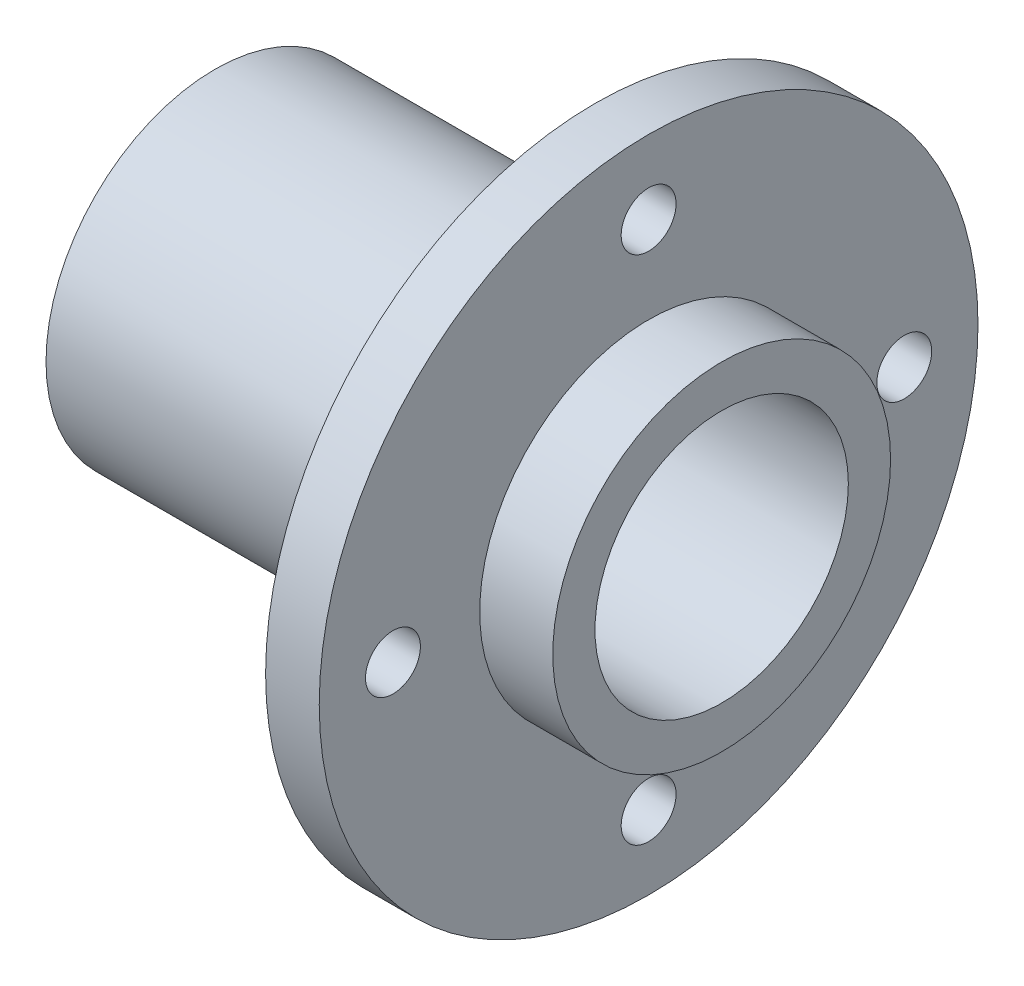
ISO-10303-21;
HEADER;
FILE_DESCRIPTION(('STEP AP214'),'2;1');
FILE_NAME('part.step','',(''),(''),'','','');
FILE_SCHEMA(('AUTOMOTIVE_DESIGN { 1 0 10303 214 1 1 1 1 }'));
ENDSEC;
DATA;
#1=APPLICATION_CONTEXT('core data for automotive mechanical design processes');
#2=APPLICATION_PROTOCOL_DEFINITION('international standard','automotive_design',2000,#1);
#3=PRODUCT_CONTEXT('',#1,'mechanical');
#4=PRODUCT('Part','Part','',(#3));
#5=PRODUCT_RELATED_PRODUCT_CATEGORY('part','',(#4));
#6=PRODUCT_DEFINITION_FORMATION('','',#4);
#7=PRODUCT_DEFINITION_CONTEXT('part definition',#1,'design');
#8=PRODUCT_DEFINITION('design','',#6,#7);
#9=PRODUCT_DEFINITION_SHAPE('','',#8);
#10=(LENGTH_UNIT() NAMED_UNIT(*) SI_UNIT(.MILLI.,.METRE.));
#11=(NAMED_UNIT(*) PLANE_ANGLE_UNIT() SI_UNIT($,.RADIAN.));
#12=(NAMED_UNIT(*) SI_UNIT($,.STERADIAN.) SOLID_ANGLE_UNIT());
#13=UNCERTAINTY_MEASURE_WITH_UNIT(LENGTH_MEASURE(1.E-05),#10,'distance_accuracy_value','');
#14=(GEOMETRIC_REPRESENTATION_CONTEXT(3) GLOBAL_UNCERTAINTY_ASSIGNED_CONTEXT((#13)) GLOBAL_UNIT_ASSIGNED_CONTEXT((#10,
#11,#12)) REPRESENTATION_CONTEXT('',''));
#15=CARTESIAN_POINT('',(0.,0.,0.));
#16=DIRECTION('',(0.,0.,1.));
#17=DIRECTION('',(1.,0.,0.));
#18=AXIS2_PLACEMENT_3D('',#15,#16,#17);
#19=CARTESIAN_POINT('',(0.,0.,0.));
#20=DIRECTION('',(1.,0.,0.));
#21=DIRECTION('',(0.,0.,-1.));
#22=AXIS2_PLACEMENT_3D('',#19,#20,#21);
#23=PLANE('',#22);
#24=CARTESIAN_POINT('',(0.,30.27,0.));
#25=DIRECTION('',(-1.,0.,0.));
#26=DIRECTION('',(0.,0.,1.));
#27=AXIS2_PLACEMENT_3D('',#24,#25,#26);
#28=CIRCLE('',#27,3.25);
#29=CARTESIAN_POINT('',(0.,30.27,3.25));
#30=VERTEX_POINT('',#29);
#31=EDGE_CURVE('E60',#30,#30,#28,.T.);
#32=ORIENTED_EDGE('',*,*,#31,.F.);
#33=EDGE_LOOP('',(#32));
#34=FACE_BOUND('',#33,.T.);
#35=CARTESIAN_POINT('',(0.,0.,-30.27));
#36=DIRECTION('',(-1.,0.,0.));
#37=DIRECTION('',(0.,0.,1.));
#38=AXIS2_PLACEMENT_3D('',#35,#36,#37);
#39=CIRCLE('',#38,3.25);
#40=CARTESIAN_POINT('',(0.,0.,-27.02));
#41=VERTEX_POINT('',#40);
#42=EDGE_CURVE('E152',#41,#41,#39,.T.);
#43=ORIENTED_EDGE('',*,*,#42,.F.);
#44=EDGE_LOOP('',(#43));
#45=FACE_BOUND('',#44,.T.);
#46=CARTESIAN_POINT('',(0.,0.,30.27));
#47=DIRECTION('',(-1.,0.,0.));
#48=DIRECTION('',(0.,0.,1.));
#49=AXIS2_PLACEMENT_3D('',#46,#47,#48);
#50=CIRCLE('',#49,3.25);
#51=CARTESIAN_POINT('',(0.,0.,33.52));
#52=VERTEX_POINT('',#51);
#53=EDGE_CURVE('E156',#52,#52,#50,.T.);
#54=ORIENTED_EDGE('',*,*,#53,.F.);
#55=EDGE_LOOP('',(#54));
#56=FACE_BOUND('',#55,.T.);
#57=CARTESIAN_POINT('',(0.,-30.27,0.));
#58=DIRECTION('',(-1.,0.,0.));
#59=DIRECTION('',(0.,0.,1.));
#60=AXIS2_PLACEMENT_3D('',#57,#58,#59);
#61=CIRCLE('',#60,3.25);
#62=CARTESIAN_POINT('',(0.,-30.27,3.25));
#63=VERTEX_POINT('',#62);
#64=EDGE_CURVE('E84',#63,#63,#61,.T.);
#65=ORIENTED_EDGE('',*,*,#64,.F.);
#66=EDGE_LOOP('',(#65));
#67=FACE_BOUND('',#66,.T.);
#68=CARTESIAN_POINT('',(0.,0.,0.));
#69=DIRECTION('',(1.,0.,0.));
#70=DIRECTION('',(0.,0.,-1.));
#71=AXIS2_PLACEMENT_3D('',#68,#69,#70);
#72=CIRCLE('',#71,39.);
#73=CARTESIAN_POINT('',(0.,0.,-39.));
#74=VERTEX_POINT('',#73);
#75=EDGE_CURVE('E51',#74,#74,#72,.T.);
#76=ORIENTED_EDGE('',*,*,#75,.F.);
#77=EDGE_LOOP('',(#76));
#78=FACE_BOUND('',#77,.T.);
#79=CARTESIAN_POINT('',(0.,0.,0.));
#80=DIRECTION('',(1.,0.,0.));
#81=DIRECTION('',(0.,0.,-1.));
#82=AXIS2_PLACEMENT_3D('',#79,#80,#81);
#83=CIRCLE('',#82,20.);
#84=CARTESIAN_POINT('',(0.,0.,-20.));
#85=VERTEX_POINT('',#84);
#86=EDGE_CURVE('E10',#85,#85,#83,.F.);
#87=ORIENTED_EDGE('',*,*,#86,.F.);
#88=EDGE_LOOP('',(#87));
#89=FACE_BOUND('',#88,.T.);
#90=ADVANCED_FACE('F36',(#34,#45,#56,#67,#78,#89),#23,.F.);
#91=CARTESIAN_POINT('',(6.35,0.,0.));
#92=DIRECTION('',(1.,0.,0.));
#93=DIRECTION('',(0.,0.,-1.));
#94=AXIS2_PLACEMENT_3D('',#91,#92,#93);
#95=PLANE('',#94);
#96=CARTESIAN_POINT('',(6.35,30.27,0.));
#97=DIRECTION('',(1.,0.,0.));
#98=DIRECTION('',(0.,0.,-1.));
#99=AXIS2_PLACEMENT_3D('',#96,#97,#98);
#100=CIRCLE('',#99,3.25);
#101=CARTESIAN_POINT('',(6.35,30.27,-3.25));
#102=VERTEX_POINT('',#101);
#103=EDGE_CURVE('E40',#102,#102,#100,.T.);
#104=ORIENTED_EDGE('',*,*,#103,.F.);
#105=EDGE_LOOP('',(#104));
#106=FACE_BOUND('',#105,.T.);
#107=CARTESIAN_POINT('',(6.35,0.,-30.27));
#108=DIRECTION('',(1.,0.,0.));
#109=DIRECTION('',(0.,0.,-1.));
#110=AXIS2_PLACEMENT_3D('',#107,#108,#109);
#111=CIRCLE('',#110,3.25);
#112=CARTESIAN_POINT('',(6.35,0.,-33.52));
#113=VERTEX_POINT('',#112);
#114=EDGE_CURVE('E63',#113,#113,#111,.T.);
#115=ORIENTED_EDGE('',*,*,#114,.F.);
#116=EDGE_LOOP('',(#115));
#117=FACE_BOUND('',#116,.T.);
#118=CARTESIAN_POINT('',(6.35,0.,30.27));
#119=DIRECTION('',(1.,0.,0.));
#120=DIRECTION('',(0.,0.,-1.));
#121=AXIS2_PLACEMENT_3D('',#118,#119,#120);
#122=CIRCLE('',#121,3.25);
#123=CARTESIAN_POINT('',(6.35,0.,27.02));
#124=VERTEX_POINT('',#123);
#125=EDGE_CURVE('E59',#124,#124,#122,.T.);
#126=ORIENTED_EDGE('',*,*,#125,.F.);
#127=EDGE_LOOP('',(#126));
#128=FACE_BOUND('',#127,.T.);
#129=CARTESIAN_POINT('',(6.35,-30.27,0.));
#130=DIRECTION('',(1.,0.,0.));
#131=DIRECTION('',(0.,0.,-1.));
#132=AXIS2_PLACEMENT_3D('',#129,#130,#131);
#133=CIRCLE('',#132,3.25);
#134=CARTESIAN_POINT('',(6.35,-30.27,-3.25));
#135=VERTEX_POINT('',#134);
#136=EDGE_CURVE('E55',#135,#135,#133,.T.);
#137=ORIENTED_EDGE('',*,*,#136,.F.);
#138=EDGE_LOOP('',(#137));
#139=FACE_BOUND('',#138,.T.);
#140=CARTESIAN_POINT('',(6.35,0.,0.));
#141=DIRECTION('',(1.,0.,0.));
#142=DIRECTION('',(0.,0.,-1.));
#143=AXIS2_PLACEMENT_3D('',#140,#141,#142);
#144=CIRCLE('',#143,39.);
#145=CARTESIAN_POINT('',(6.35,0.,-39.));
#146=VERTEX_POINT('',#145);
#147=EDGE_CURVE('E45',#146,#146,#144,.T.);
#148=ORIENTED_EDGE('',*,*,#147,.T.);
#149=EDGE_LOOP('',(#148));
#150=FACE_BOUND('',#149,.T.);
#151=CARTESIAN_POINT('',(6.35,0.,0.));
#152=DIRECTION('',(1.,0.,0.));
#153=DIRECTION('',(0.,0.,-1.));
#154=AXIS2_PLACEMENT_3D('',#151,#152,#153);
#155=CIRCLE('',#154,20.);
#156=CARTESIAN_POINT('',(6.35,0.,-20.));
#157=VERTEX_POINT('',#156);
#158=EDGE_CURVE('E90',#157,#157,#155,.T.);
#159=ORIENTED_EDGE('',*,*,#158,.F.);
#160=EDGE_LOOP('',(#159));
#161=FACE_BOUND('',#160,.T.);
#162=ADVANCED_FACE('F101',(#106,#117,#128,#139,#150,#161),#95,.T.);
#163=CARTESIAN_POINT('',(6.35,0.,0.));
#164=DIRECTION('',(-1.,0.,0.));
#165=DIRECTION('',(0.,0.,1.));
#166=AXIS2_PLACEMENT_3D('',#163,#164,#165);
#167=CYLINDRICAL_SURFACE('',#166,39.);
#168=ORIENTED_EDGE('',*,*,#147,.F.);
#169=EDGE_LOOP('',(#168));
#170=FACE_BOUND('',#169,.T.);
#171=ORIENTED_EDGE('',*,*,#75,.T.);
#172=EDGE_LOOP('',(#171));
#173=FACE_BOUND('',#172,.T.);
#174=ADVANCED_FACE('F38',(#170,#173),#167,.T.);
#175=CARTESIAN_POINT('',(0.,0.,0.));
#176=DIRECTION('',(1.,0.,0.));
#177=DIRECTION('',(0.,0.,-1.));
#178=AXIS2_PLACEMENT_3D('',#175,#176,#177);
#179=CYLINDRICAL_SURFACE('',#178,15.);
#180=CARTESIAN_POINT('',(15.,0.,0.));
#181=DIRECTION('',(1.,0.,0.));
#182=DIRECTION('',(0.,0.,-1.));
#183=AXIS2_PLACEMENT_3D('',#180,#181,#182);
#184=CIRCLE('',#183,15.);
#185=CARTESIAN_POINT('',(15.,0.,-15.));
#186=VERTEX_POINT('',#185);
#187=EDGE_CURVE('E81',#186,#186,#184,.T.);
#188=ORIENTED_EDGE('',*,*,#187,.T.);
#189=EDGE_LOOP('',(#188));
#190=FACE_BOUND('',#189,.T.);
#191=CARTESIAN_POINT('',(-45.,0.,0.));
#192=DIRECTION('',(-1.,0.,0.));
#193=DIRECTION('',(0.,0.,1.));
#194=AXIS2_PLACEMENT_3D('',#191,#192,#193);
#195=CIRCLE('',#194,15.);
#196=CARTESIAN_POINT('',(-45.,0.,15.));
#197=VERTEX_POINT('',#196);
#198=EDGE_CURVE('E70',#197,#197,#195,.T.);
#199=ORIENTED_EDGE('',*,*,#198,.T.);
#200=EDGE_LOOP('',(#199));
#201=FACE_BOUND('',#200,.T.);
#202=ADVANCED_FACE('F110',(#190,#201),#179,.F.);
#203=CARTESIAN_POINT('',(15.,0.,0.));
#204=DIRECTION('',(1.,0.,0.));
#205=DIRECTION('',(0.,0.,-1.));
#206=AXIS2_PLACEMENT_3D('',#203,#204,#205);
#207=PLANE('',#206);
#208=CARTESIAN_POINT('',(15.,0.,0.));
#209=DIRECTION('',(1.,0.,0.));
#210=DIRECTION('',(0.,0.,-1.));
#211=AXIS2_PLACEMENT_3D('',#208,#209,#210);
#212=CIRCLE('',#211,20.);
#213=CARTESIAN_POINT('',(15.,0.,-20.));
#214=VERTEX_POINT('',#213);
#215=EDGE_CURVE('E91',#214,#214,#212,.T.);
#216=ORIENTED_EDGE('',*,*,#215,.T.);
#217=EDGE_LOOP('',(#216));
#218=FACE_BOUND('',#217,.T.);
#219=ORIENTED_EDGE('',*,*,#187,.F.);
#220=EDGE_LOOP('',(#219));
#221=FACE_BOUND('',#220,.T.);
#222=ADVANCED_FACE('F117',(#218,#221),#207,.T.);
#223=CARTESIAN_POINT('',(15.,0.,0.));
#224=DIRECTION('',(-1.,0.,0.));
#225=DIRECTION('',(0.,0.,1.));
#226=AXIS2_PLACEMENT_3D('',#223,#224,#225);
#227=CYLINDRICAL_SURFACE('',#226,20.);
#228=ORIENTED_EDGE('',*,*,#215,.F.);
#229=EDGE_LOOP('',(#228));
#230=FACE_BOUND('',#229,.T.);
#231=ORIENTED_EDGE('',*,*,#158,.T.);
#232=EDGE_LOOP('',(#231));
#233=FACE_BOUND('',#232,.T.);
#234=ADVANCED_FACE('F99',(#230,#233),#227,.T.);
#235=CARTESIAN_POINT('',(-45.,0.,0.));
#236=DIRECTION('',(-1.,0.,0.));
#237=DIRECTION('',(0.,0.,1.));
#238=AXIS2_PLACEMENT_3D('',#235,#236,#237);
#239=PLANE('',#238);
#240=CARTESIAN_POINT('',(-45.,0.,0.));
#241=DIRECTION('',(-1.,0.,0.));
#242=DIRECTION('',(0.,0.,1.));
#243=AXIS2_PLACEMENT_3D('',#240,#241,#242);
#244=CIRCLE('',#243,20.);
#245=CARTESIAN_POINT('',(-45.,0.,20.));
#246=VERTEX_POINT('',#245);
#247=EDGE_CURVE('E75',#246,#246,#244,.T.);
#248=ORIENTED_EDGE('',*,*,#247,.T.);
#249=EDGE_LOOP('',(#248));
#250=FACE_BOUND('',#249,.T.);
#251=ORIENTED_EDGE('',*,*,#198,.F.);
#252=EDGE_LOOP('',(#251));
#253=FACE_BOUND('',#252,.T.);
#254=ADVANCED_FACE('F121',(#250,#253),#239,.T.);
#255=CARTESIAN_POINT('',(-45.,0.,0.));
#256=DIRECTION('',(1.,0.,0.));
#257=DIRECTION('',(0.,0.,-1.));
#258=AXIS2_PLACEMENT_3D('',#255,#256,#257);
#259=CYLINDRICAL_SURFACE('',#258,20.);
#260=ORIENTED_EDGE('',*,*,#247,.F.);
#261=EDGE_LOOP('',(#260));
#262=FACE_BOUND('',#261,.T.);
#263=ORIENTED_EDGE('',*,*,#86,.T.);
#264=EDGE_LOOP('',(#263));
#265=FACE_BOUND('',#264,.T.);
#266=ADVANCED_FACE('F126',(#262,#265),#259,.T.);
#267=CARTESIAN_POINT('',(45.,-30.27,0.));
#268=DIRECTION('',(-1.,0.,0.));
#269=DIRECTION('',(0.,0.,1.));
#270=AXIS2_PLACEMENT_3D('',#267,#268,#269);
#271=CYLINDRICAL_SURFACE('',#270,3.25);
#272=ORIENTED_EDGE('',*,*,#136,.T.);
#273=EDGE_LOOP('',(#272));
#274=FACE_BOUND('',#273,.T.);
#275=ORIENTED_EDGE('',*,*,#64,.T.);
#276=EDGE_LOOP('',(#275));
#277=FACE_BOUND('',#276,.T.);
#278=ADVANCED_FACE('F129',(#274,#277),#271,.F.);
#279=CARTESIAN_POINT('',(45.,0.,30.27));
#280=DIRECTION('',(-1.,0.,0.));
#281=DIRECTION('',(0.,0.,1.));
#282=AXIS2_PLACEMENT_3D('',#279,#280,#281);
#283=CYLINDRICAL_SURFACE('',#282,3.25);
#284=ORIENTED_EDGE('',*,*,#125,.T.);
#285=EDGE_LOOP('',(#284));
#286=FACE_BOUND('',#285,.T.);
#287=ORIENTED_EDGE('',*,*,#53,.T.);
#288=EDGE_LOOP('',(#287));
#289=FACE_BOUND('',#288,.T.);
#290=ADVANCED_FACE('F136',(#286,#289),#283,.F.);
#291=CARTESIAN_POINT('',(45.,0.,-30.27));
#292=DIRECTION('',(-1.,0.,0.));
#293=DIRECTION('',(0.,0.,1.));
#294=AXIS2_PLACEMENT_3D('',#291,#292,#293);
#295=CYLINDRICAL_SURFACE('',#294,3.25);
#296=ORIENTED_EDGE('',*,*,#114,.T.);
#297=EDGE_LOOP('',(#296));
#298=FACE_BOUND('',#297,.T.);
#299=ORIENTED_EDGE('',*,*,#42,.T.);
#300=EDGE_LOOP('',(#299));
#301=FACE_BOUND('',#300,.T.);
#302=ADVANCED_FACE('F140',(#298,#301),#295,.F.);
#303=CARTESIAN_POINT('',(45.,30.27,0.));
#304=DIRECTION('',(-1.,0.,0.));
#305=DIRECTION('',(0.,0.,1.));
#306=AXIS2_PLACEMENT_3D('',#303,#304,#305);
#307=CYLINDRICAL_SURFACE('',#306,3.25);
#308=ORIENTED_EDGE('',*,*,#103,.T.);
#309=EDGE_LOOP('',(#308));
#310=FACE_BOUND('',#309,.T.);
#311=ORIENTED_EDGE('',*,*,#31,.T.);
#312=EDGE_LOOP('',(#311));
#313=FACE_BOUND('',#312,.T.);
#314=ADVANCED_FACE('F144',(#310,#313),#307,.F.);
#315=CLOSED_SHELL('',(#90,#162,#174,#202,#222,#234,#254,#266,#278,#290,#302,#314));
#316=MANIFOLD_SOLID_BREP('B2',#315);
#317=ADVANCED_BREP_SHAPE_REPRESENTATION('',(#18,#316),#14);
#318=SHAPE_DEFINITION_REPRESENTATION(#9,#317);
ENDSEC;
END-ISO-10303-21;
